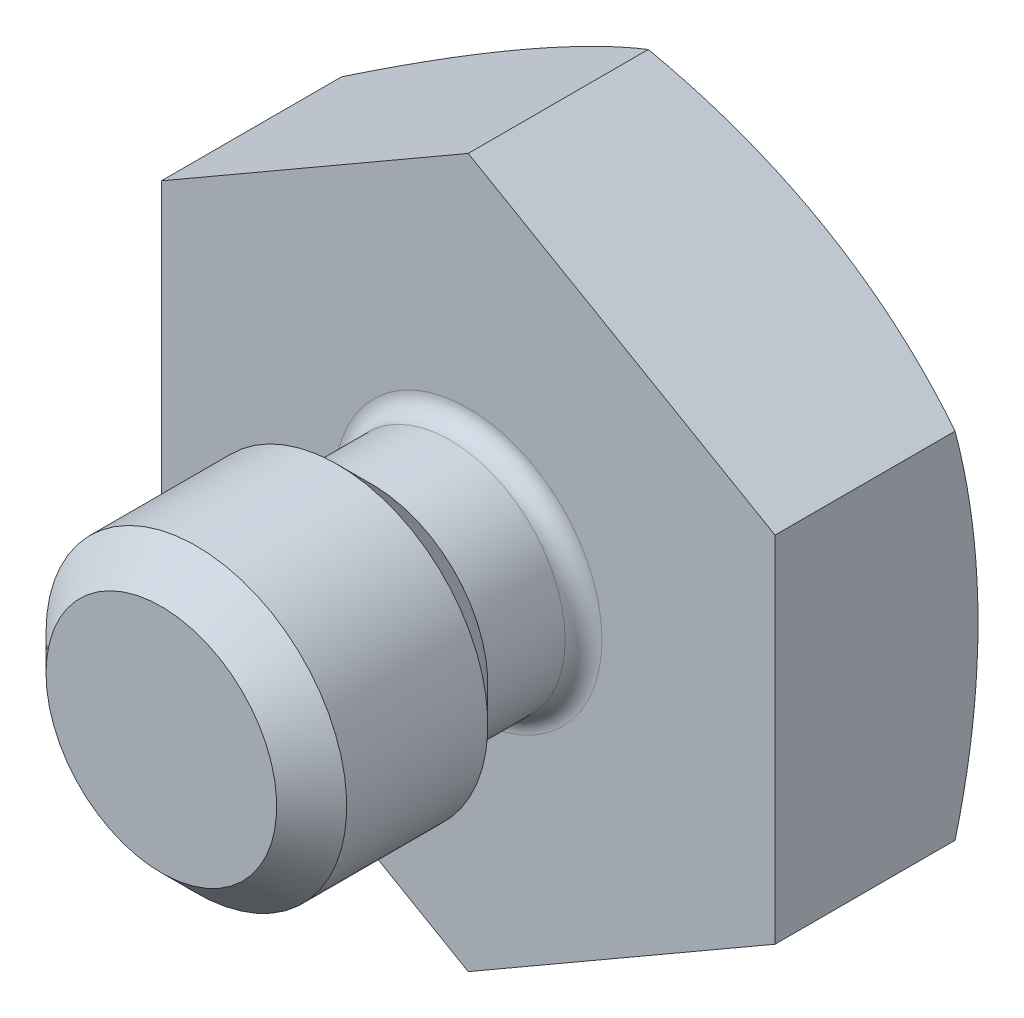
ISO-10303-21;
HEADER;
FILE_DESCRIPTION(('STEP AP214'),'2;1');
FILE_NAME('part.step','',(''),(''),'','','');
FILE_SCHEMA(('AUTOMOTIVE_DESIGN { 1 0 10303 214 1 1 1 1 }'));
ENDSEC;
DATA;
#1=APPLICATION_CONTEXT('core data for automotive mechanical design processes');
#2=APPLICATION_PROTOCOL_DEFINITION('international standard','automotive_design',2000,#1);
#3=PRODUCT_CONTEXT('',#1,'mechanical');
#4=PRODUCT('Part','Part','',(#3));
#5=PRODUCT_RELATED_PRODUCT_CATEGORY('part','',(#4));
#6=PRODUCT_DEFINITION_FORMATION('','',#4);
#7=PRODUCT_DEFINITION_CONTEXT('part definition',#1,'design');
#8=PRODUCT_DEFINITION('design','',#6,#7);
#9=PRODUCT_DEFINITION_SHAPE('','',#8);
#10=(LENGTH_UNIT() NAMED_UNIT(*) SI_UNIT(.MILLI.,.METRE.));
#11=(NAMED_UNIT(*) PLANE_ANGLE_UNIT() SI_UNIT($,.RADIAN.));
#12=(NAMED_UNIT(*) SI_UNIT($,.STERADIAN.) SOLID_ANGLE_UNIT());
#13=UNCERTAINTY_MEASURE_WITH_UNIT(LENGTH_MEASURE(1.E-05),#10,'distance_accuracy_value','');
#14=(GEOMETRIC_REPRESENTATION_CONTEXT(3) GLOBAL_UNCERTAINTY_ASSIGNED_CONTEXT((#13)) GLOBAL_UNIT_ASSIGNED_CONTEXT((#10,
#11,#12)) REPRESENTATION_CONTEXT('',''));
#15=CARTESIAN_POINT('',(0.,0.,0.));
#16=DIRECTION('',(0.,0.,1.));
#17=DIRECTION('',(1.,0.,0.));
#18=AXIS2_PLACEMENT_3D('',#15,#16,#17);
#19=CARTESIAN_POINT('',(0.,11.9891228770081,0.));
#20=DIRECTION('',(0.,0.,1.));
#21=DIRECTION('',(1.,0.,0.));
#22=AXIS2_PLACEMENT_3D('',#19,#20,#21);
#23=PLANE('',#22);
#24=CARTESIAN_POINT('',(0.,0.,0.));
#25=DIRECTION('',(0.,0.,1.));
#26=DIRECTION('',(1.,0.,0.));
#27=AXIS2_PLACEMENT_3D('',#24,#25,#26);
#28=CIRCLE('',#27,2.7686);
#29=CARTESIAN_POINT('',(2.7686,0.,0.));
#30=VERTEX_POINT('',#29);
#31=EDGE_CURVE('E42',#30,#30,#28,.F.);
#32=ORIENTED_EDGE('',*,*,#31,.T.);
#33=EDGE_LOOP('',(#32));
#34=FACE_BOUND('',#33,.T.);
#35=DIRECTION('',(0.,1.,0.));
#36=VECTOR('',#35,1.);
#37=CARTESIAN_POINT('',(6.35,-3.66617420935413,0.));
#38=LINE('',#37,#36);
#39=CARTESIAN_POINT('',(6.35,-3.66617420935413,0.));
#40=VERTEX_POINT('',#39);
#41=CARTESIAN_POINT('',(6.34999999999999,3.66617420935413,0.));
#42=VERTEX_POINT('',#41);
#43=EDGE_CURVE('E115',#40,#42,#38,.T.);
#44=ORIENTED_EDGE('',*,*,#43,.T.);
#45=DIRECTION('',(-0.866025403784439,0.5,0.));
#46=VECTOR('',#45,1.);
#47=CARTESIAN_POINT('',(6.34999999999999,3.66617420935413,0.));
#48=LINE('',#47,#46);
#49=CARTESIAN_POINT('',(0.,7.33234841870825,0.));
#50=VERTEX_POINT('',#49);
#51=EDGE_CURVE('E110',#42,#50,#48,.T.);
#52=ORIENTED_EDGE('',*,*,#51,.T.);
#53=DIRECTION('',(-0.866025403784439,-0.5,0.));
#54=VECTOR('',#53,1.);
#55=CARTESIAN_POINT('',(0.,7.33234841870825,0.));
#56=LINE('',#55,#54);
#57=CARTESIAN_POINT('',(-6.35,3.66617420935412,0.));
#58=VERTEX_POINT('',#57);
#59=EDGE_CURVE('E108',#50,#58,#56,.T.);
#60=ORIENTED_EDGE('',*,*,#59,.T.);
#61=DIRECTION('',(0.,-1.,0.));
#62=VECTOR('',#61,1.);
#63=CARTESIAN_POINT('',(-6.35,3.66617420935412,0.));
#64=LINE('',#63,#62);
#65=CARTESIAN_POINT('',(-6.35,-3.66617420935412,0.));
#66=VERTEX_POINT('',#65);
#67=EDGE_CURVE('E57',#58,#66,#64,.T.);
#68=ORIENTED_EDGE('',*,*,#67,.T.);
#69=DIRECTION('',(0.866025403784439,-0.5,0.));
#70=VECTOR('',#69,1.);
#71=CARTESIAN_POINT('',(-6.35,-3.66617420935412,0.));
#72=LINE('',#71,#70);
#73=CARTESIAN_POINT('',(0.,-7.33234841870825,0.));
#74=VERTEX_POINT('',#73);
#75=EDGE_CURVE('E97',#66,#74,#72,.T.);
#76=ORIENTED_EDGE('',*,*,#75,.T.);
#77=DIRECTION('',(0.866025403784439,0.5,0.));
#78=VECTOR('',#77,1.);
#79=CARTESIAN_POINT('',(0.,-7.33234841870825,0.));
#80=LINE('',#79,#78);
#81=EDGE_CURVE('E103',#74,#40,#80,.T.);
#82=ORIENTED_EDGE('',*,*,#81,.T.);
#83=EDGE_LOOP('',(#44,#52,#60,#68,#76,#82));
#84=FACE_BOUND('',#83,.T.);
#85=ADVANCED_FACE('F34',(#34,#84),#23,.T.);
#86=CARTESIAN_POINT('',(0.,0.,0.));
#87=DIRECTION('',(0.,0.,-1.));
#88=DIRECTION('',(-1.,0.,0.));
#89=AXIS2_PLACEMENT_3D('',#86,#87,#88);
#90=CYLINDRICAL_SURFACE('',#89,2.3876);
#91=CARTESIAN_POINT('',(0.,0.,0.380999999999999));
#92=DIRECTION('',(0.,0.,1.));
#93=DIRECTION('',(1.,0.,0.));
#94=AXIS2_PLACEMENT_3D('',#91,#92,#93);
#95=CIRCLE('',#94,2.3876);
#96=CARTESIAN_POINT('',(2.3876,0.,0.380999999999999));
#97=VERTEX_POINT('',#96);
#98=EDGE_CURVE('E12',#97,#97,#95,.T.);
#99=ORIENTED_EDGE('',*,*,#98,.T.);
#100=EDGE_LOOP('',(#99));
#101=FACE_BOUND('',#100,.T.);
#102=CARTESIAN_POINT('',(0.,0.,1.9812));
#103=DIRECTION('',(0.,0.,-1.));
#104=DIRECTION('',(-1.,0.,0.));
#105=AXIS2_PLACEMENT_3D('',#102,#103,#104);
#106=CIRCLE('',#105,2.3876);
#107=CARTESIAN_POINT('',(-2.3876,0.,1.9812));
#108=VERTEX_POINT('',#107);
#109=EDGE_CURVE('E148',#108,#108,#106,.T.);
#110=ORIENTED_EDGE('',*,*,#109,.T.);
#111=EDGE_LOOP('',(#110));
#112=FACE_BOUND('',#111,.T.);
#113=ADVANCED_FACE('F165',(#101,#112),#90,.T.);
#114=CARTESIAN_POINT('',(0.,0.,1.9812));
#115=DIRECTION('',(0.,0.,1.));
#116=DIRECTION('',(1.,0.,0.));
#117=AXIS2_PLACEMENT_3D('',#114,#115,#116);
#118=CONICAL_SURFACE('',#117,2.3876,0.785398163397446);
#119=CARTESIAN_POINT('',(0.,0.,2.7051));
#120=DIRECTION('',(0.,0.,-1.));
#121=DIRECTION('',(-1.,0.,0.));
#122=AXIS2_PLACEMENT_3D('',#119,#120,#121);
#123=CIRCLE('',#122,3.1115);
#124=CARTESIAN_POINT('',(-3.1115,0.,2.7051));
#125=VERTEX_POINT('',#124);
#126=EDGE_CURVE('E145',#125,#125,#123,.T.);
#127=ORIENTED_EDGE('',*,*,#126,.T.);
#128=EDGE_LOOP('',(#127));
#129=FACE_BOUND('',#128,.T.);
#130=ORIENTED_EDGE('',*,*,#109,.F.);
#131=EDGE_LOOP('',(#130));
#132=FACE_BOUND('',#131,.T.);
#133=ADVANCED_FACE('F170',(#129,#132),#118,.T.);
#134=CARTESIAN_POINT('',(0.,0.,0.));
#135=DIRECTION('',(0.,0.,-1.));
#136=DIRECTION('',(-1.,0.,0.));
#137=AXIS2_PLACEMENT_3D('',#134,#135,#136);
#138=CYLINDRICAL_SURFACE('',#137,3.1115);
#139=CARTESIAN_POINT('',(0.,0.,5.6261));
#140=DIRECTION('',(0.,0.,-1.));
#141=DIRECTION('',(-1.,0.,0.));
#142=AXIS2_PLACEMENT_3D('',#139,#140,#141);
#143=CIRCLE('',#142,3.1115);
#144=CARTESIAN_POINT('',(-3.1115,0.,5.6261));
#145=VERTEX_POINT('',#144);
#146=EDGE_CURVE('E142',#145,#145,#143,.T.);
#147=ORIENTED_EDGE('',*,*,#146,.T.);
#148=EDGE_LOOP('',(#147));
#149=FACE_BOUND('',#148,.T.);
#150=ORIENTED_EDGE('',*,*,#126,.F.);
#151=EDGE_LOOP('',(#150));
#152=FACE_BOUND('',#151,.T.);
#153=ADVANCED_FACE('F183',(#149,#152),#138,.T.);
#154=CARTESIAN_POINT('',(0.,0.,5.6261));
#155=DIRECTION('',(0.,0.,-1.));
#156=DIRECTION('',(-1.,0.,0.));
#157=AXIS2_PLACEMENT_3D('',#154,#155,#156);
#158=CONICAL_SURFACE('',#157,3.1115,0.785398163397451);
#159=CARTESIAN_POINT('',(0.,0.,6.35));
#160=DIRECTION('',(0.,0.,-1.));
#161=DIRECTION('',(-1.,0.,0.));
#162=AXIS2_PLACEMENT_3D('',#159,#160,#161);
#163=CIRCLE('',#162,2.3876);
#164=CARTESIAN_POINT('',(-2.3876,0.,6.35));
#165=VERTEX_POINT('',#164);
#166=EDGE_CURVE('E139',#165,#165,#163,.T.);
#167=ORIENTED_EDGE('',*,*,#166,.T.);
#168=EDGE_LOOP('',(#167));
#169=FACE_BOUND('',#168,.T.);
#170=ORIENTED_EDGE('',*,*,#146,.F.);
#171=EDGE_LOOP('',(#170));
#172=FACE_BOUND('',#171,.T.);
#173=ADVANCED_FACE('F179',(#169,#172),#158,.T.);
#174=CARTESIAN_POINT('',(0.,2.3876,6.35));
#175=DIRECTION('',(0.,0.,1.));
#176=DIRECTION('',(1.,0.,0.));
#177=AXIS2_PLACEMENT_3D('',#174,#175,#176);
#178=PLANE('',#177);
#179=ORIENTED_EDGE('',*,*,#166,.F.);
#180=EDGE_LOOP('',(#179));
#181=FACE_BOUND('',#180,.T.);
#182=ADVANCED_FACE('F176',(#181),#178,.T.);
#183=CARTESIAN_POINT('',(6.34999999999999,3.66617420935413,-5.5372));
#184=DIRECTION('',(0.5,0.866025403784439,0.));
#185=DIRECTION('',(-0.866025403784438,0.5,0.));
#186=AXIS2_PLACEMENT_3D('',#183,#184,#185);
#187=PLANE('',#186);
#188=DIRECTION('',(0.,0.,1.));
#189=VECTOR('',#188,1.);
#190=CARTESIAN_POINT('',(0.,7.33234841870825,-5.5372));
#191=LINE('',#190,#189);
#192=CARTESIAN_POINT('',(0.,7.33234841870825,-3.72606373136606));
#193=VERTEX_POINT('',#192);
#194=EDGE_CURVE('E49',#193,#50,#191,.T.);
#195=ORIENTED_EDGE('',*,*,#194,.T.);
#196=ORIENTED_EDGE('',*,*,#51,.F.);
#197=DIRECTION('',(0.,0.,1.));
#198=VECTOR('',#197,1.);
#199=CARTESIAN_POINT('',(6.34999999999999,3.66617420935413,-5.5372));
#200=LINE('',#199,#198);
#201=CARTESIAN_POINT('',(6.34999999999999,3.66617420935413,-3.72606373136606));
#202=VERTEX_POINT('',#201);
#203=EDGE_CURVE('E117',#202,#42,#200,.T.);
#204=ORIENTED_EDGE('',*,*,#203,.F.);
#205=CARTESIAN_POINT('',(3.175,5.49926131403119,10.2108));
#206=DIRECTION('',(0.5,0.866025403784439,0.));
#207=DIRECTION('',(-0.866025403784438,0.5,0.));
#208=AXIS2_PLACEMENT_3D('',#205,#206,#207);
#209=CIRCLE('',#208,14.4110028797443);
#210=EDGE_CURVE('E136',#193,#202,#209,.F.);
#211=ORIENTED_EDGE('',*,*,#210,.F.);
#212=EDGE_LOOP('',(#195,#196,#204,#211));
#213=FACE_BOUND('',#212,.T.);
#214=ADVANCED_FACE('F173',(#213),#187,.T.);
#215=CARTESIAN_POINT('',(6.35,-3.66617420935413,-5.5372));
#216=DIRECTION('',(1.,0.,0.));
#217=DIRECTION('',(0.,1.,0.));
#218=AXIS2_PLACEMENT_3D('',#215,#216,#217);
#219=PLANE('',#218);
#220=ORIENTED_EDGE('',*,*,#203,.T.);
#221=ORIENTED_EDGE('',*,*,#43,.F.);
#222=DIRECTION('',(0.,0.,1.));
#223=VECTOR('',#222,1.);
#224=CARTESIAN_POINT('',(6.35,-3.66617420935413,-5.5372));
#225=LINE('',#224,#223);
#226=CARTESIAN_POINT('',(6.35,-3.66617420935413,-3.72606373136606));
#227=VERTEX_POINT('',#226);
#228=EDGE_CURVE('E120',#227,#40,#225,.T.);
#229=ORIENTED_EDGE('',*,*,#228,.F.);
#230=CARTESIAN_POINT('',(6.35,0.,10.2108));
#231=DIRECTION('',(1.,0.,0.));
#232=DIRECTION('',(0.,1.,0.));
#233=AXIS2_PLACEMENT_3D('',#230,#231,#232);
#234=CIRCLE('',#233,14.4110028797444);
#235=EDGE_CURVE('E133',#202,#227,#234,.F.);
#236=ORIENTED_EDGE('',*,*,#235,.F.);
#237=EDGE_LOOP('',(#220,#221,#229,#236));
#238=FACE_BOUND('',#237,.T.);
#239=ADVANCED_FACE('F217',(#238),#219,.T.);
#240=CARTESIAN_POINT('',(0.,-7.33234841870825,-5.5372));
#241=DIRECTION('',(0.5,-0.866025403784439,0.));
#242=DIRECTION('',(0.866025403784439,0.5,0.));
#243=AXIS2_PLACEMENT_3D('',#240,#241,#242);
#244=PLANE('',#243);
#245=ORIENTED_EDGE('',*,*,#228,.T.);
#246=ORIENTED_EDGE('',*,*,#81,.F.);
#247=DIRECTION('',(0.,0.,1.));
#248=VECTOR('',#247,1.);
#249=CARTESIAN_POINT('',(0.,-7.33234841870825,-5.5372));
#250=LINE('',#249,#248);
#251=CARTESIAN_POINT('',(0.,-7.33234841870825,-3.72606373136606));
#252=VERTEX_POINT('',#251);
#253=EDGE_CURVE('E93',#252,#74,#250,.T.);
#254=ORIENTED_EDGE('',*,*,#253,.F.);
#255=CARTESIAN_POINT('',(3.175,-5.49926131403119,10.2108));
#256=DIRECTION('',(0.5,-0.866025403784439,0.));
#257=DIRECTION('',(0.866025403784439,0.5,0.));
#258=AXIS2_PLACEMENT_3D('',#255,#256,#257);
#259=CIRCLE('',#258,14.4110028797443);
#260=EDGE_CURVE('E130',#227,#252,#259,.F.);
#261=ORIENTED_EDGE('',*,*,#260,.F.);
#262=EDGE_LOOP('',(#245,#246,#254,#261));
#263=FACE_BOUND('',#262,.T.);
#264=ADVANCED_FACE('F224',(#263),#244,.T.);
#265=CARTESIAN_POINT('',(-6.35,-3.66617420935412,-5.5372));
#266=DIRECTION('',(-0.5,-0.866025403784439,0.));
#267=DIRECTION('',(0.866025403784439,-0.5,0.));
#268=AXIS2_PLACEMENT_3D('',#265,#266,#267);
#269=PLANE('',#268);
#270=ORIENTED_EDGE('',*,*,#253,.T.);
#271=ORIENTED_EDGE('',*,*,#75,.F.);
#272=DIRECTION('',(0.,0.,1.));
#273=VECTOR('',#272,1.);
#274=CARTESIAN_POINT('',(-6.35,-3.66617420935412,-5.5372));
#275=LINE('',#274,#273);
#276=CARTESIAN_POINT('',(-6.35,-3.66617420935412,-3.72606373136606));
#277=VERTEX_POINT('',#276);
#278=EDGE_CURVE('E86',#277,#66,#275,.T.);
#279=ORIENTED_EDGE('',*,*,#278,.F.);
#280=CARTESIAN_POINT('',(-3.175,-5.49926131403119,10.2108));
#281=DIRECTION('',(-0.5,-0.866025403784439,0.));
#282=DIRECTION('',(0.866025403784439,-0.5,0.));
#283=AXIS2_PLACEMENT_3D('',#280,#281,#282);
#284=CIRCLE('',#283,14.4110028797443);
#285=EDGE_CURVE('E128',#252,#277,#284,.F.);
#286=ORIENTED_EDGE('',*,*,#285,.F.);
#287=EDGE_LOOP('',(#270,#271,#279,#286));
#288=FACE_BOUND('',#287,.T.);
#289=ADVANCED_FACE('F98',(#288),#269,.T.);
#290=CARTESIAN_POINT('',(-6.35,3.66617420935412,-5.5372));
#291=DIRECTION('',(-1.,0.,0.));
#292=DIRECTION('',(0.,0.,1.));
#293=AXIS2_PLACEMENT_3D('',#290,#291,#292);
#294=PLANE('',#293);
#295=ORIENTED_EDGE('',*,*,#278,.T.);
#296=ORIENTED_EDGE('',*,*,#67,.F.);
#297=DIRECTION('',(0.,0.,1.));
#298=VECTOR('',#297,1.);
#299=CARTESIAN_POINT('',(-6.35,3.66617420935412,-5.5372));
#300=LINE('',#299,#298);
#301=CARTESIAN_POINT('',(-6.35,3.66617420935412,-3.72606373136606));
#302=VERTEX_POINT('',#301);
#303=EDGE_CURVE('E94',#302,#58,#300,.T.);
#304=ORIENTED_EDGE('',*,*,#303,.F.);
#305=CARTESIAN_POINT('',(-6.35,0.,10.2108));
#306=DIRECTION('',(-1.,0.,0.));
#307=DIRECTION('',(0.,0.,1.));
#308=AXIS2_PLACEMENT_3D('',#305,#306,#307);
#309=CIRCLE('',#308,14.4110028797443);
#310=EDGE_CURVE('E90',#277,#302,#309,.F.);
#311=ORIENTED_EDGE('',*,*,#310,.F.);
#312=EDGE_LOOP('',(#295,#296,#304,#311));
#313=FACE_BOUND('',#312,.T.);
#314=ADVANCED_FACE('F88',(#313),#294,.T.);
#315=CARTESIAN_POINT('',(0.,7.33234841870825,-5.5372));
#316=DIRECTION('',(-0.5,0.866025403784439,0.));
#317=DIRECTION('',(-0.866025403784439,-0.5,0.));
#318=AXIS2_PLACEMENT_3D('',#315,#316,#317);
#319=PLANE('',#318);
#320=ORIENTED_EDGE('',*,*,#303,.T.);
#321=ORIENTED_EDGE('',*,*,#59,.F.);
#322=ORIENTED_EDGE('',*,*,#194,.F.);
#323=CARTESIAN_POINT('',(-3.175,5.49926131403118,10.2108));
#324=DIRECTION('',(-0.5,0.866025403784439,0.));
#325=DIRECTION('',(-0.866025403784439,-0.5,0.));
#326=AXIS2_PLACEMENT_3D('',#323,#324,#325);
#327=CIRCLE('',#326,14.4110028797444);
#328=EDGE_CURVE('E119',#302,#193,#327,.F.);
#329=ORIENTED_EDGE('',*,*,#328,.F.);
#330=EDGE_LOOP('',(#320,#321,#322,#329));
#331=FACE_BOUND('',#330,.T.);
#332=ADVANCED_FACE('F160',(#331),#319,.T.);
#333=CARTESIAN_POINT('',(0.,0.,10.2108));
#334=DIRECTION('',(0.,0.,-1.));
#335=DIRECTION('',(0.,1.,0.));
#336=AXIS2_PLACEMENT_3D('',#333,#334,#335);
#337=SPHERICAL_SURFACE('',#336,15.748);
#338=ORIENTED_EDGE('',*,*,#328,.T.);
#339=ORIENTED_EDGE('',*,*,#210,.T.);
#340=ORIENTED_EDGE('',*,*,#235,.T.);
#341=ORIENTED_EDGE('',*,*,#260,.T.);
#342=ORIENTED_EDGE('',*,*,#285,.T.);
#343=ORIENTED_EDGE('',*,*,#310,.T.);
#344=EDGE_LOOP('',(#338,#339,#340,#341,#342,#343));
#345=FACE_BOUND('',#344,.T.);
#346=ADVANCED_FACE('F155',(#345),#337,.T.);
#347=CARTESIAN_POINT('',(0.,0.,0.380999999999999));
#348=DIRECTION('',(0.,0.,1.));
#349=DIRECTION('',(1.,0.,0.));
#350=AXIS2_PLACEMENT_3D('',#347,#348,#349);
#351=TOROIDAL_SURFACE('',#350,2.7686,0.381);
#352=ORIENTED_EDGE('',*,*,#98,.F.);
#353=EDGE_LOOP('',(#352));
#354=FACE_BOUND('',#353,.T.);
#355=ORIENTED_EDGE('',*,*,#31,.F.);
#356=EDGE_LOOP('',(#355));
#357=FACE_BOUND('',#356,.T.);
#358=ADVANCED_FACE('F36',(#354,#357),#351,.F.);
#359=CLOSED_SHELL('',(#85,#113,#133,#153,#173,#182,#214,#239,#264,#289,#314,#332,#346,#358));
#360=MANIFOLD_SOLID_BREP('B2',#359);
#361=ADVANCED_BREP_SHAPE_REPRESENTATION('',(#18,#360),#14);
#362=SHAPE_DEFINITION_REPRESENTATION(#9,#361);
ENDSEC;
END-ISO-10303-21;
